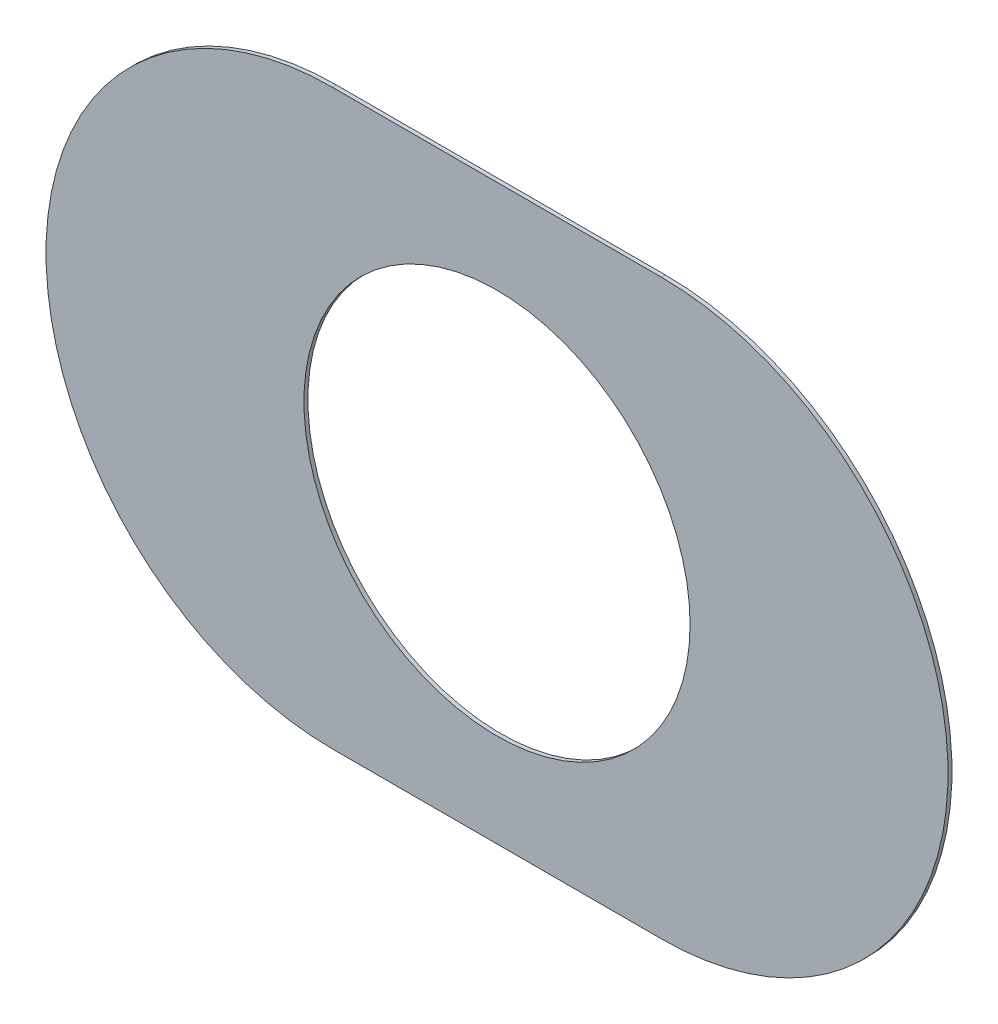
ISO-10303-21;
HEADER;
FILE_DESCRIPTION(('STEP AP214'),'2;1');
FILE_NAME('part.step','',(''),(''),'','','');
FILE_SCHEMA(('AUTOMOTIVE_DESIGN { 1 0 10303 214 1 1 1 1 }'));
ENDSEC;
DATA;
#1=APPLICATION_CONTEXT('core data for automotive mechanical design processes');
#2=APPLICATION_PROTOCOL_DEFINITION('international standard','automotive_design',2000,#1);
#3=PRODUCT_CONTEXT('',#1,'mechanical');
#4=PRODUCT('Part','Part','',(#3));
#5=PRODUCT_RELATED_PRODUCT_CATEGORY('part','',(#4));
#6=PRODUCT_DEFINITION_FORMATION('','',#4);
#7=PRODUCT_DEFINITION_CONTEXT('part definition',#1,'design');
#8=PRODUCT_DEFINITION('design','',#6,#7);
#9=PRODUCT_DEFINITION_SHAPE('','',#8);
#10=(LENGTH_UNIT() NAMED_UNIT(*) SI_UNIT(.MILLI.,.METRE.));
#11=(NAMED_UNIT(*) PLANE_ANGLE_UNIT() SI_UNIT($,.RADIAN.));
#12=(NAMED_UNIT(*) SI_UNIT($,.STERADIAN.) SOLID_ANGLE_UNIT());
#13=UNCERTAINTY_MEASURE_WITH_UNIT(LENGTH_MEASURE(1.E-05),#10,'distance_accuracy_value','');
#14=(GEOMETRIC_REPRESENTATION_CONTEXT(3) GLOBAL_UNCERTAINTY_ASSIGNED_CONTEXT((#13)) GLOBAL_UNIT_ASSIGNED_CONTEXT((#10,
#11,#12)) REPRESENTATION_CONTEXT('',''));
#15=CARTESIAN_POINT('',(0.,0.,0.));
#16=DIRECTION('',(0.,0.,1.));
#17=DIRECTION('',(1.,0.,0.));
#18=AXIS2_PLACEMENT_3D('',#15,#16,#17);
#19=CARTESIAN_POINT('',(24.3000003427268,39.9400006854535,0.));
#20=DIRECTION('',(0.,0.,1.));
#21=DIRECTION('',(1.,0.,0.));
#22=AXIS2_PLACEMENT_3D('',#19,#20,#21);
#23=PLANE('',#22);
#24=CARTESIAN_POINT('',(24.3000003427268,39.9400006854535,0.));
#25=DIRECTION('',(0.,0.,-1.));
#26=DIRECTION('',(-1.,0.,0.));
#27=AXIS2_PLACEMENT_3D('',#24,#25,#26);
#28=CIRCLE('',#27,0.49);
#29=CARTESIAN_POINT('',(24.7900003427268,39.9400006854535,0.));
#30=VERTEX_POINT('',#29);
#31=EDGE_CURVE('E106',#30,#30,#28,.T.);
#32=ORIENTED_EDGE('',*,*,#31,.T.);
#33=EDGE_LOOP('',(#32));
#34=FACE_BOUND('',#33,.T.);
#35=CARTESIAN_POINT('',(23.8825938881802,39.9400006854535,0.));
#36=DIRECTION('',(0.,0.,1.));
#37=DIRECTION('',(0.,1.,0.));
#38=AXIS2_PLACEMENT_3D('',#35,#36,#37);
#39=CIRCLE('',#38,0.727257121659981);
#40=CARTESIAN_POINT('',(23.8825938881802,40.6672578071135,0.));
#41=VERTEX_POINT('',#40);
#42=CARTESIAN_POINT('',(23.8825938881802,39.2127435637935,0.));
#43=VERTEX_POINT('',#42);
#44=EDGE_CURVE('E21',#41,#43,#39,.T.);
#45=ORIENTED_EDGE('',*,*,#44,.T.);
#46=DIRECTION('',(1.,0.,0.));
#47=VECTOR('',#46,1.);
#48=CARTESIAN_POINT('',(23.8825938881802,39.2127435637935,0.));
#49=LINE('',#48,#47);
#50=CARTESIAN_POINT('',(24.7174067972734,39.2127435637935,0.));
#51=VERTEX_POINT('',#50);
#52=EDGE_CURVE('E123',#43,#51,#49,.T.);
#53=ORIENTED_EDGE('',*,*,#52,.T.);
#54=CARTESIAN_POINT('',(24.7174067972734,39.9400006854535,0.));
#55=DIRECTION('',(0.,0.,1.));
#56=DIRECTION('',(0.,-1.,0.));
#57=AXIS2_PLACEMENT_3D('',#54,#55,#56);
#58=CIRCLE('',#57,0.727257121659981);
#59=CARTESIAN_POINT('',(24.7174067972734,40.6672578071135,0.));
#60=VERTEX_POINT('',#59);
#61=EDGE_CURVE('E75',#51,#60,#58,.T.);
#62=ORIENTED_EDGE('',*,*,#61,.T.);
#63=DIRECTION('',(-1.,0.,0.));
#64=VECTOR('',#63,1.);
#65=CARTESIAN_POINT('',(24.7174067972734,40.6672578071135,0.));
#66=LINE('',#65,#64);
#67=EDGE_CURVE('E102',#60,#41,#66,.T.);
#68=ORIENTED_EDGE('',*,*,#67,.T.);
#69=EDGE_LOOP('',(#45,#53,#62,#68));
#70=FACE_BOUND('',#69,.T.);
#71=ADVANCED_FACE('F17',(#34,#70),#23,.T.);
#72=CARTESIAN_POINT('',(24.3000003427268,39.9400006854535,-0.01));
#73=DIRECTION('',(0.,0.,1.));
#74=DIRECTION('',(1.,0.,0.));
#75=AXIS2_PLACEMENT_3D('',#72,#73,#74);
#76=PLANE('',#75);
#77=CARTESIAN_POINT('',(24.3000003427268,39.9400006854535,-0.01));
#78=DIRECTION('',(0.,0.,-1.));
#79=DIRECTION('',(-1.,0.,0.));
#80=AXIS2_PLACEMENT_3D('',#77,#78,#79);
#81=CIRCLE('',#80,0.49);
#82=CARTESIAN_POINT('',(24.7900003427268,39.9400006854535,-0.01));
#83=VERTEX_POINT('',#82);
#84=EDGE_CURVE('E116',#83,#83,#81,.T.);
#85=ORIENTED_EDGE('',*,*,#84,.F.);
#86=EDGE_LOOP('',(#85));
#87=FACE_BOUND('',#86,.T.);
#88=CARTESIAN_POINT('',(23.8825938881802,39.9400006854535,-0.01));
#89=DIRECTION('',(0.,0.,1.));
#90=DIRECTION('',(0.,1.,0.));
#91=AXIS2_PLACEMENT_3D('',#88,#89,#90);
#92=CIRCLE('',#91,0.727257121659981);
#93=CARTESIAN_POINT('',(23.8825938881802,40.6672578071135,-0.01));
#94=VERTEX_POINT('',#93);
#95=CARTESIAN_POINT('',(23.8825938881802,39.2127435637935,-0.01));
#96=VERTEX_POINT('',#95);
#97=EDGE_CURVE('E11',#94,#96,#92,.T.);
#98=ORIENTED_EDGE('',*,*,#97,.F.);
#99=DIRECTION('',(-1.,0.,0.));
#100=VECTOR('',#99,1.);
#101=CARTESIAN_POINT('',(24.7174067972734,40.6672578071135,-0.01));
#102=LINE('',#101,#100);
#103=CARTESIAN_POINT('',(24.7174067972734,40.6672578071135,-0.01));
#104=VERTEX_POINT('',#103);
#105=EDGE_CURVE('E85',#104,#94,#102,.T.);
#106=ORIENTED_EDGE('',*,*,#105,.F.);
#107=CARTESIAN_POINT('',(24.7174067972734,39.9400006854535,-0.01));
#108=DIRECTION('',(0.,0.,1.));
#109=DIRECTION('',(0.,-1.,0.));
#110=AXIS2_PLACEMENT_3D('',#107,#108,#109);
#111=CIRCLE('',#110,0.727257121659981);
#112=CARTESIAN_POINT('',(24.7174067972734,39.2127435637935,-0.01));
#113=VERTEX_POINT('',#112);
#114=EDGE_CURVE('E113',#113,#104,#111,.T.);
#115=ORIENTED_EDGE('',*,*,#114,.F.);
#116=DIRECTION('',(1.,0.,0.));
#117=VECTOR('',#116,1.);
#118=CARTESIAN_POINT('',(23.8825938881802,39.2127435637935,-0.01));
#119=LINE('',#118,#117);
#120=EDGE_CURVE('E87',#96,#113,#119,.T.);
#121=ORIENTED_EDGE('',*,*,#120,.F.);
#122=EDGE_LOOP('',(#98,#106,#115,#121));
#123=FACE_BOUND('',#122,.T.);
#124=ADVANCED_FACE('F82',(#87,#123),#76,.F.);
#125=CARTESIAN_POINT('',(23.8825938881802,39.9400006854535,0.));
#126=DIRECTION('',(0.,0.,1.));
#127=DIRECTION('',(0.,1.,0.));
#128=AXIS2_PLACEMENT_3D('',#125,#126,#127);
#129=CYLINDRICAL_SURFACE('',#128,0.727257121659981);
#130=ORIENTED_EDGE('',*,*,#44,.F.);
#131=DIRECTION('',(0.,0.,-1.));
#132=VECTOR('',#131,1.);
#133=CARTESIAN_POINT('',(23.8825938881802,40.6672578071135,0.));
#134=LINE('',#133,#132);
#135=EDGE_CURVE('E89',#41,#94,#134,.T.);
#136=ORIENTED_EDGE('',*,*,#135,.T.);
#137=ORIENTED_EDGE('',*,*,#97,.T.);
#138=DIRECTION('',(0.,0.,-1.));
#139=VECTOR('',#138,1.);
#140=CARTESIAN_POINT('',(23.8825938881802,39.2127435637935,0.));
#141=LINE('',#140,#139);
#142=EDGE_CURVE('E121',#43,#96,#141,.T.);
#143=ORIENTED_EDGE('',*,*,#142,.F.);
#144=EDGE_LOOP('',(#130,#136,#137,#143));
#145=FACE_BOUND('',#144,.T.);
#146=ADVANCED_FACE('F19',(#145),#129,.T.);
#147=CARTESIAN_POINT('',(23.8825938881802,39.2127435637935,0.));
#148=DIRECTION('',(0.,1.,0.));
#149=DIRECTION('',(1.,0.,0.));
#150=AXIS2_PLACEMENT_3D('',#147,#148,#149);
#151=PLANE('',#150);
#152=ORIENTED_EDGE('',*,*,#52,.F.);
#153=ORIENTED_EDGE('',*,*,#142,.T.);
#154=ORIENTED_EDGE('',*,*,#120,.T.);
#155=DIRECTION('',(0.,0.,-1.));
#156=VECTOR('',#155,1.);
#157=CARTESIAN_POINT('',(24.7174067972734,39.2127435637935,0.));
#158=LINE('',#157,#156);
#159=EDGE_CURVE('E109',#51,#113,#158,.T.);
#160=ORIENTED_EDGE('',*,*,#159,.F.);
#161=EDGE_LOOP('',(#152,#153,#154,#160));
#162=FACE_BOUND('',#161,.T.);
#163=ADVANCED_FACE('F156',(#162),#151,.F.);
#164=CARTESIAN_POINT('',(24.7174067972734,39.9400006854535,0.));
#165=DIRECTION('',(0.,0.,1.));
#166=DIRECTION('',(0.,-1.,0.));
#167=AXIS2_PLACEMENT_3D('',#164,#165,#166);
#168=CYLINDRICAL_SURFACE('',#167,0.727257121659981);
#169=ORIENTED_EDGE('',*,*,#61,.F.);
#170=ORIENTED_EDGE('',*,*,#159,.T.);
#171=ORIENTED_EDGE('',*,*,#114,.T.);
#172=DIRECTION('',(0.,0.,-1.));
#173=VECTOR('',#172,1.);
#174=CARTESIAN_POINT('',(24.7174067972734,40.6672578071135,0.));
#175=LINE('',#174,#173);
#176=EDGE_CURVE('E95',#60,#104,#175,.T.);
#177=ORIENTED_EDGE('',*,*,#176,.F.);
#178=EDGE_LOOP('',(#169,#170,#171,#177));
#179=FACE_BOUND('',#178,.T.);
#180=ADVANCED_FACE('F159',(#179),#168,.T.);
#181=CARTESIAN_POINT('',(24.7174067972734,40.6672578071135,0.));
#182=DIRECTION('',(0.,-1.,0.));
#183=DIRECTION('',(0.,0.,-1.));
#184=AXIS2_PLACEMENT_3D('',#181,#182,#183);
#185=PLANE('',#184);
#186=ORIENTED_EDGE('',*,*,#67,.F.);
#187=ORIENTED_EDGE('',*,*,#176,.T.);
#188=ORIENTED_EDGE('',*,*,#105,.T.);
#189=ORIENTED_EDGE('',*,*,#135,.F.);
#190=EDGE_LOOP('',(#186,#187,#188,#189));
#191=FACE_BOUND('',#190,.T.);
#192=ADVANCED_FACE('F94',(#191),#185,.F.);
#193=CARTESIAN_POINT('',(24.3000003427268,39.9400006854535,0.));
#194=DIRECTION('',(0.,0.,1.));
#195=DIRECTION('',(-1.,0.,0.));
#196=AXIS2_PLACEMENT_3D('',#193,#194,#195);
#197=CYLINDRICAL_SURFACE('',#196,0.49);
#198=ORIENTED_EDGE('',*,*,#84,.T.);
#199=DIRECTION('',(0.,0.,1.));
#200=VECTOR('',#199,1.);
#201=CARTESIAN_POINT('',(24.7900003427268,39.9400006854535,0.));
#202=LINE('',#201,#200);
#203=EDGE_CURVE('E120',#83,#30,#202,.T.);
#204=ORIENTED_EDGE('',*,*,#203,.T.);
#205=ORIENTED_EDGE('',*,*,#31,.F.);
#206=ORIENTED_EDGE('',*,*,#203,.F.);
#207=EDGE_LOOP('',(#198,#204,#205,#206));
#208=FACE_BOUND('',#207,.T.);
#209=ADVANCED_FACE('F143',(#208),#197,.F.);
#210=CLOSED_SHELL('',(#71,#124,#146,#163,#180,#192,#209));
#211=MANIFOLD_SOLID_BREP('B1',#210);
#212=ADVANCED_BREP_SHAPE_REPRESENTATION('',(#18,#211),#14);
#213=SHAPE_DEFINITION_REPRESENTATION(#9,#212);
ENDSEC;
END-ISO-10303-21;
